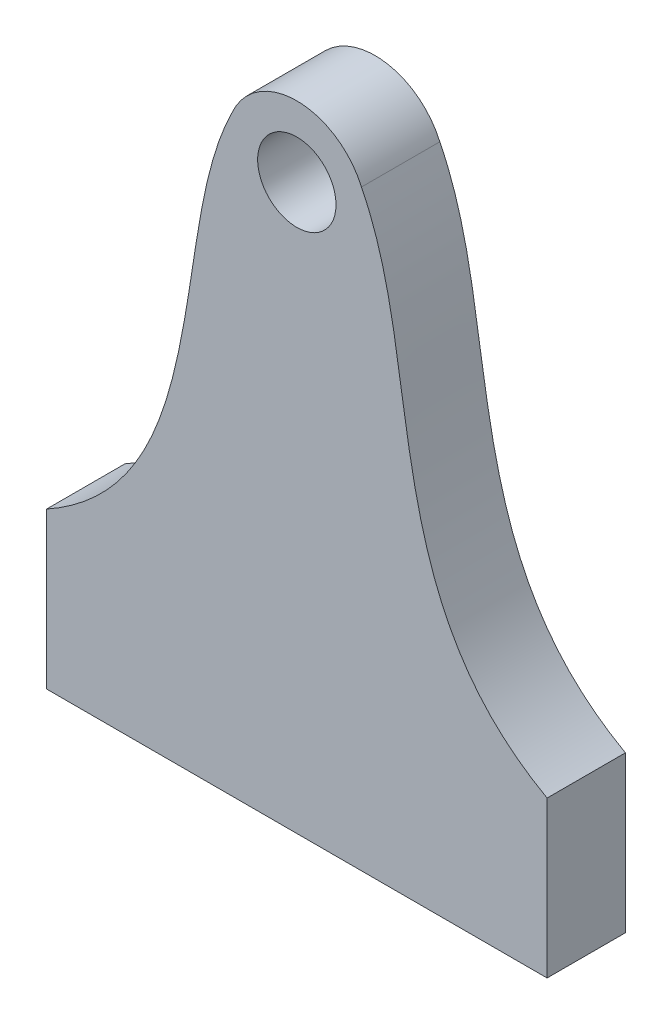
ISO-10303-21;
HEADER;
FILE_DESCRIPTION(('STEP AP214'),'2;1');
FILE_NAME('part.step','',(''),(''),'','','');
FILE_SCHEMA(('AUTOMOTIVE_DESIGN { 1 0 10303 214 1 1 1 1 }'));
ENDSEC;
DATA;
#1=APPLICATION_CONTEXT('core data for automotive mechanical design processes');
#2=APPLICATION_PROTOCOL_DEFINITION('international standard','automotive_design',2000,#1);
#3=PRODUCT_CONTEXT('',#1,'mechanical');
#4=PRODUCT('Part','Part','',(#3));
#5=PRODUCT_RELATED_PRODUCT_CATEGORY('part','',(#4));
#6=PRODUCT_DEFINITION_FORMATION('','',#4);
#7=PRODUCT_DEFINITION_CONTEXT('part definition',#1,'design');
#8=PRODUCT_DEFINITION('design','',#6,#7);
#9=PRODUCT_DEFINITION_SHAPE('','',#8);
#10=(LENGTH_UNIT() NAMED_UNIT(*) SI_UNIT(.MILLI.,.METRE.));
#11=(NAMED_UNIT(*) PLANE_ANGLE_UNIT() SI_UNIT($,.RADIAN.));
#12=(NAMED_UNIT(*) SI_UNIT($,.STERADIAN.) SOLID_ANGLE_UNIT());
#13=UNCERTAINTY_MEASURE_WITH_UNIT(LENGTH_MEASURE(1.E-05),#10,'distance_accuracy_value','');
#14=(GEOMETRIC_REPRESENTATION_CONTEXT(3) GLOBAL_UNCERTAINTY_ASSIGNED_CONTEXT((#13)) GLOBAL_UNIT_ASSIGNED_CONTEXT((#10,
#11,#12)) REPRESENTATION_CONTEXT('',''));
#15=CARTESIAN_POINT('',(0.,0.,0.));
#16=DIRECTION('',(0.,0.,1.));
#17=DIRECTION('',(1.,0.,0.));
#18=AXIS2_PLACEMENT_3D('',#15,#16,#17);
#19=CARTESIAN_POINT('',(-9.67372975735439,28.6354351603486,6.35));
#20=DIRECTION('',(0.,0.,-1.));
#21=DIRECTION('',(-1.,0.,0.));
#22=AXIS2_PLACEMENT_3D('',#19,#20,#21);
#23=PLANE('',#22);
#24=CARTESIAN_POINT('',(-5.23993974240772,48.0012839577607,6.35));
#25=CARTESIAN_POINT('',(-7.1271701966972,44.2325554837698,6.35));
#26=CARTESIAN_POINT('',(-9.14548831018189,30.7666468239852,6.35));
#27=CARTESIAN_POINT('',(-11.3215543087763,17.6270458118897,6.35));
#28=CARTESIAN_POINT('',(-20.2849106431369,12.6324591373556,6.35));
#29=B_SPLINE_CURVE_WITH_KNOTS('',3,(#24,#25,#26,#27,#28),.UNSPECIFIED.,.F.,.F.,(4,1,4),(0.,
0.277399137267628,0.844926430606917),.UNSPECIFIED.);
#30=CARTESIAN_POINT('',(-5.23993974240772,48.0012839577607,6.35));
#31=VERTEX_POINT('',#30);
#32=CARTESIAN_POINT('',(-20.2849106431369,12.6324591373556,6.35));
#33=VERTEX_POINT('',#32);
#34=EDGE_CURVE('E175',#31,#33,#29,.T.);
#35=ORIENTED_EDGE('',*,*,#34,.T.);
#36=DIRECTION('',(0.,-1.,0.));
#37=VECTOR('',#36,1.);
#38=CARTESIAN_POINT('',(-20.2849106431369,0.,6.35));
#39=LINE('',#38,#37);
#40=CARTESIAN_POINT('',(-20.2849106431369,0.,6.35));
#41=VERTEX_POINT('',#40);
#42=EDGE_CURVE('E96',#33,#41,#39,.T.);
#43=ORIENTED_EDGE('',*,*,#42,.T.);
#44=DIRECTION('',(1.,0.,0.));
#45=VECTOR('',#44,1.);
#46=CARTESIAN_POINT('',(20.2849106431369,0.,6.35));
#47=LINE('',#46,#45);
#48=CARTESIAN_POINT('',(20.2849106431369,0.,6.35));
#49=VERTEX_POINT('',#48);
#50=EDGE_CURVE('E109',#41,#49,#47,.T.);
#51=ORIENTED_EDGE('',*,*,#50,.T.);
#52=DIRECTION('',(0.,1.,0.));
#53=VECTOR('',#52,1.);
#54=CARTESIAN_POINT('',(20.2849106431369,0.,6.35));
#55=LINE('',#54,#53);
#56=CARTESIAN_POINT('',(20.2849106431369,12.6324591373556,6.35));
#57=VERTEX_POINT('',#56);
#58=EDGE_CURVE('E103',#49,#57,#55,.T.);
#59=ORIENTED_EDGE('',*,*,#58,.T.);
#60=CARTESIAN_POINT('',(20.2849106431369,12.6324591373556,6.35));
#61=CARTESIAN_POINT('',(11.3215543087763,17.6270458118897,6.35));
#62=CARTESIAN_POINT('',(9.1454883101819,30.7666468239852,6.35));
#63=CARTESIAN_POINT('',(7.1271701966972,44.2325554837698,6.35));
#64=CARTESIAN_POINT('',(5.23993974240772,48.0012839577607,6.35));
#65=B_SPLINE_CURVE_WITH_KNOTS('',3,(#60,#61,#62,#63,#64),.UNSPECIFIED.,.F.,.F.,(4,1,4),(0.,
0.567527293339289,0.844926430606917),.UNSPECIFIED.);
#66=CARTESIAN_POINT('',(5.23993974240772,48.0012839577607,6.35));
#67=VERTEX_POINT('',#66);
#68=EDGE_CURVE('E107',#57,#67,#65,.T.);
#69=ORIENTED_EDGE('',*,*,#68,.T.);
#70=CARTESIAN_POINT('',(0.,45.72,6.35));
#71=DIRECTION('',(0.,0.,1.));
#72=DIRECTION('',(1.,0.,0.));
#73=AXIS2_PLACEMENT_3D('',#70,#71,#72);
#74=CIRCLE('',#73,5.715);
#75=EDGE_CURVE('E59',#67,#31,#74,.T.);
#76=ORIENTED_EDGE('',*,*,#75,.T.);
#77=EDGE_LOOP('',(#35,#43,#51,#59,#69,#76));
#78=FACE_BOUND('',#77,.T.);
#79=CARTESIAN_POINT('',(0.,45.72,6.35));
#80=DIRECTION('',(0.,0.,1.));
#81=DIRECTION('',(1.,0.,0.));
#82=AXIS2_PLACEMENT_3D('',#79,#80,#81);
#83=CIRCLE('',#82,3.175);
#84=CARTESIAN_POINT('',(3.175,45.72,6.35));
#85=VERTEX_POINT('',#84);
#86=EDGE_CURVE('E167',#85,#85,#83,.T.);
#87=ORIENTED_EDGE('',*,*,#86,.F.);
#88=EDGE_LOOP('',(#87));
#89=FACE_BOUND('',#88,.T.);
#90=ADVANCED_FACE('F41',(#78,#89),#23,.F.);
#91=CARTESIAN_POINT('',(-9.67372975735439,28.6354351603486,0.));
#92=DIRECTION('',(0.,0.,-1.));
#93=DIRECTION('',(-1.,0.,0.));
#94=AXIS2_PLACEMENT_3D('',#91,#92,#93);
#95=PLANE('',#94);
#96=CARTESIAN_POINT('',(-5.23993974240772,48.0012839577607,0.));
#97=CARTESIAN_POINT('',(-7.1271701966972,44.2325554837698,0.));
#98=CARTESIAN_POINT('',(-9.14548831018189,30.7666468239852,0.));
#99=CARTESIAN_POINT('',(-11.3215543087763,17.6270458118897,0.));
#100=CARTESIAN_POINT('',(-20.2849106431369,12.6324591373556,0.));
#101=B_SPLINE_CURVE_WITH_KNOTS('',3,(#96,#97,#98,#99,#100),.UNSPECIFIED.,.F.,.F.,(4,1,4),(0.,
0.277399137267628,0.844926430606917),.UNSPECIFIED.);
#102=CARTESIAN_POINT('',(-5.23993974240772,48.0012839577607,0.));
#103=VERTEX_POINT('',#102);
#104=CARTESIAN_POINT('',(-20.2849106431369,12.6324591373556,0.));
#105=VERTEX_POINT('',#104);
#106=EDGE_CURVE('E173',#103,#105,#101,.T.);
#107=ORIENTED_EDGE('',*,*,#106,.F.);
#108=CARTESIAN_POINT('',(0.,45.72,0.));
#109=DIRECTION('',(0.,0.,1.));
#110=DIRECTION('',(1.,0.,0.));
#111=AXIS2_PLACEMENT_3D('',#108,#109,#110);
#112=CIRCLE('',#111,5.715);
#113=CARTESIAN_POINT('',(5.23993974240772,48.0012839577607,0.));
#114=VERTEX_POINT('',#113);
#115=EDGE_CURVE('E88',#114,#103,#112,.T.);
#116=ORIENTED_EDGE('',*,*,#115,.F.);
#117=CARTESIAN_POINT('',(20.2849106431369,12.6324591373556,0.));
#118=CARTESIAN_POINT('',(11.3215543087763,17.6270458118897,0.));
#119=CARTESIAN_POINT('',(9.1454883101819,30.7666468239852,0.));
#120=CARTESIAN_POINT('',(7.1271701966972,44.2325554837698,0.));
#121=CARTESIAN_POINT('',(5.23993974240772,48.0012839577607,0.));
#122=B_SPLINE_CURVE_WITH_KNOTS('',3,(#117,#118,#119,#120,#121),.UNSPECIFIED.,.F.,.F.,(4,1,4),
(0.,0.567527293339289,0.844926430606917),.UNSPECIFIED.);
#123=CARTESIAN_POINT('',(20.2849106431369,12.6324591373556,0.));
#124=VERTEX_POINT('',#123);
#125=EDGE_CURVE('E82',#124,#114,#122,.T.);
#126=ORIENTED_EDGE('',*,*,#125,.F.);
#127=DIRECTION('',(0.,1.,0.));
#128=VECTOR('',#127,1.);
#129=CARTESIAN_POINT('',(20.2849106431369,0.,0.));
#130=LINE('',#129,#128);
#131=CARTESIAN_POINT('',(20.2849106431369,0.,0.));
#132=VERTEX_POINT('',#131);
#133=EDGE_CURVE('E117',#132,#124,#130,.T.);
#134=ORIENTED_EDGE('',*,*,#133,.F.);
#135=DIRECTION('',(1.,0.,0.));
#136=VECTOR('',#135,1.);
#137=CARTESIAN_POINT('',(20.2849106431369,0.,0.));
#138=LINE('',#137,#136);
#139=CARTESIAN_POINT('',(-20.2849106431369,0.,0.));
#140=VERTEX_POINT('',#139);
#141=EDGE_CURVE('E188',#140,#132,#138,.T.);
#142=ORIENTED_EDGE('',*,*,#141,.F.);
#143=DIRECTION('',(0.,-1.,0.));
#144=VECTOR('',#143,1.);
#145=CARTESIAN_POINT('',(-20.2849106431369,0.,0.));
#146=LINE('',#145,#144);
#147=EDGE_CURVE('E186',#105,#140,#146,.T.);
#148=ORIENTED_EDGE('',*,*,#147,.F.);
#149=EDGE_LOOP('',(#107,#116,#126,#134,#142,#148));
#150=FACE_BOUND('',#149,.T.);
#151=CARTESIAN_POINT('',(0.,45.72,0.));
#152=DIRECTION('',(0.,0.,1.));
#153=DIRECTION('',(1.,0.,0.));
#154=AXIS2_PLACEMENT_3D('',#151,#152,#153);
#155=CIRCLE('',#154,3.175);
#156=CARTESIAN_POINT('',(3.175,45.72,0.));
#157=VERTEX_POINT('',#156);
#158=EDGE_CURVE('E170',#157,#157,#155,.T.);
#159=ORIENTED_EDGE('',*,*,#158,.T.);
#160=EDGE_LOOP('',(#159));
#161=FACE_BOUND('',#160,.T.);
#162=ADVANCED_FACE('F149',(#150,#161),#95,.T.);
#163=DIRECTION('',(0.,0.,-1.));
#164=VECTOR('',#163,1.);
#165=SURFACE_OF_LINEAR_EXTRUSION('',#29,#164);
#166=ORIENTED_EDGE('',*,*,#106,.T.);
#167=DIRECTION('',(0.,0.,-1.));
#168=VECTOR('',#167,1.);
#169=CARTESIAN_POINT('',(-20.2849106431369,12.6324591373556,6.35));
#170=LINE('',#169,#168);
#171=EDGE_CURVE('E11',#33,#105,#170,.T.);
#172=ORIENTED_EDGE('',*,*,#171,.F.);
#173=ORIENTED_EDGE('',*,*,#34,.F.);
#174=DIRECTION('',(0.,0.,-1.));
#175=VECTOR('',#174,1.);
#176=CARTESIAN_POINT('',(-5.23993974240772,48.0012839577607,6.35));
#177=LINE('',#176,#175);
#178=EDGE_CURVE('E123',#31,#103,#177,.T.);
#179=ORIENTED_EDGE('',*,*,#178,.T.);
#180=EDGE_LOOP('',(#166,#172,#173,#179));
#181=FACE_BOUND('',#180,.T.);
#182=ADVANCED_FACE('F43',(#181),#165,.F.);
#183=CARTESIAN_POINT('',(-20.2849106431369,0.,6.35));
#184=DIRECTION('',(1.,0.,0.));
#185=DIRECTION('',(0.,0.,-1.));
#186=AXIS2_PLACEMENT_3D('',#183,#184,#185);
#187=PLANE('',#186);
#188=ORIENTED_EDGE('',*,*,#147,.T.);
#189=DIRECTION('',(0.,0.,-1.));
#190=VECTOR('',#189,1.);
#191=CARTESIAN_POINT('',(-20.2849106431369,0.,6.35));
#192=LINE('',#191,#190);
#193=EDGE_CURVE('E51',#41,#140,#192,.T.);
#194=ORIENTED_EDGE('',*,*,#193,.F.);
#195=ORIENTED_EDGE('',*,*,#42,.F.);
#196=ORIENTED_EDGE('',*,*,#171,.T.);
#197=EDGE_LOOP('',(#188,#194,#195,#196));
#198=FACE_BOUND('',#197,.T.);
#199=ADVANCED_FACE('F143',(#198),#187,.F.);
#200=CARTESIAN_POINT('',(20.2849106431369,0.,6.35));
#201=DIRECTION('',(0.,1.,0.));
#202=DIRECTION('',(0.,0.,1.));
#203=AXIS2_PLACEMENT_3D('',#200,#201,#202);
#204=PLANE('',#203);
#205=ORIENTED_EDGE('',*,*,#141,.T.);
#206=DIRECTION('',(0.,0.,-1.));
#207=VECTOR('',#206,1.);
#208=CARTESIAN_POINT('',(20.2849106431369,0.,6.35));
#209=LINE('',#208,#207);
#210=EDGE_CURVE('E118',#49,#132,#209,.T.);
#211=ORIENTED_EDGE('',*,*,#210,.F.);
#212=ORIENTED_EDGE('',*,*,#50,.F.);
#213=ORIENTED_EDGE('',*,*,#193,.T.);
#214=EDGE_LOOP('',(#205,#211,#212,#213));
#215=FACE_BOUND('',#214,.T.);
#216=ADVANCED_FACE('F141',(#215),#204,.F.);
#217=CARTESIAN_POINT('',(20.2849106431369,0.,6.35));
#218=DIRECTION('',(-1.,0.,0.));
#219=DIRECTION('',(0.,0.,1.));
#220=AXIS2_PLACEMENT_3D('',#217,#218,#219);
#221=PLANE('',#220);
#222=ORIENTED_EDGE('',*,*,#133,.T.);
#223=DIRECTION('',(0.,0.,-1.));
#224=VECTOR('',#223,1.);
#225=CARTESIAN_POINT('',(20.2849106431369,12.6324591373556,6.35));
#226=LINE('',#225,#224);
#227=EDGE_CURVE('E114',#57,#124,#226,.T.);
#228=ORIENTED_EDGE('',*,*,#227,.F.);
#229=ORIENTED_EDGE('',*,*,#58,.F.);
#230=ORIENTED_EDGE('',*,*,#210,.T.);
#231=EDGE_LOOP('',(#222,#228,#229,#230));
#232=FACE_BOUND('',#231,.T.);
#233=ADVANCED_FACE('F115',(#232),#221,.F.);
#234=DIRECTION('',(0.,0.,-1.));
#235=VECTOR('',#234,1.);
#236=SURFACE_OF_LINEAR_EXTRUSION('',#65,#235);
#237=ORIENTED_EDGE('',*,*,#125,.T.);
#238=DIRECTION('',(0.,0.,-1.));
#239=VECTOR('',#238,1.);
#240=CARTESIAN_POINT('',(5.23993974240772,48.0012839577607,6.35));
#241=LINE('',#240,#239);
#242=EDGE_CURVE('E119',#67,#114,#241,.T.);
#243=ORIENTED_EDGE('',*,*,#242,.F.);
#244=ORIENTED_EDGE('',*,*,#68,.F.);
#245=ORIENTED_EDGE('',*,*,#227,.T.);
#246=EDGE_LOOP('',(#237,#243,#244,#245));
#247=FACE_BOUND('',#246,.T.);
#248=ADVANCED_FACE('F121',(#247),#236,.F.);
#249=CARTESIAN_POINT('',(0.,45.72,6.35));
#250=DIRECTION('',(0.,0.,-1.));
#251=DIRECTION('',(-1.,0.,0.));
#252=AXIS2_PLACEMENT_3D('',#249,#250,#251);
#253=CYLINDRICAL_SURFACE('',#252,5.715);
#254=ORIENTED_EDGE('',*,*,#115,.T.);
#255=ORIENTED_EDGE('',*,*,#178,.F.);
#256=ORIENTED_EDGE('',*,*,#75,.F.);
#257=ORIENTED_EDGE('',*,*,#242,.T.);
#258=EDGE_LOOP('',(#254,#255,#256,#257));
#259=FACE_BOUND('',#258,.T.);
#260=ADVANCED_FACE('F137',(#259),#253,.T.);
#261=CARTESIAN_POINT('',(0.,45.72,6.35));
#262=DIRECTION('',(0.,0.,-1.));
#263=DIRECTION('',(-1.,0.,0.));
#264=AXIS2_PLACEMENT_3D('',#261,#262,#263);
#265=CYLINDRICAL_SURFACE('',#264,3.175);
#266=ORIENTED_EDGE('',*,*,#86,.T.);
#267=EDGE_LOOP('',(#266));
#268=FACE_BOUND('',#267,.T.);
#269=ORIENTED_EDGE('',*,*,#158,.F.);
#270=EDGE_LOOP('',(#269));
#271=FACE_BOUND('',#270,.T.);
#272=ADVANCED_FACE('F158',(#268,#271),#265,.F.);
#273=CLOSED_SHELL('',(#90,#162,#182,#199,#216,#233,#248,#260,#272));
#274=MANIFOLD_SOLID_BREP('B2',#273);
#275=ADVANCED_BREP_SHAPE_REPRESENTATION('',(#18,#274),#14);
#276=SHAPE_DEFINITION_REPRESENTATION(#9,#275);
ENDSEC;
END-ISO-10303-21;
